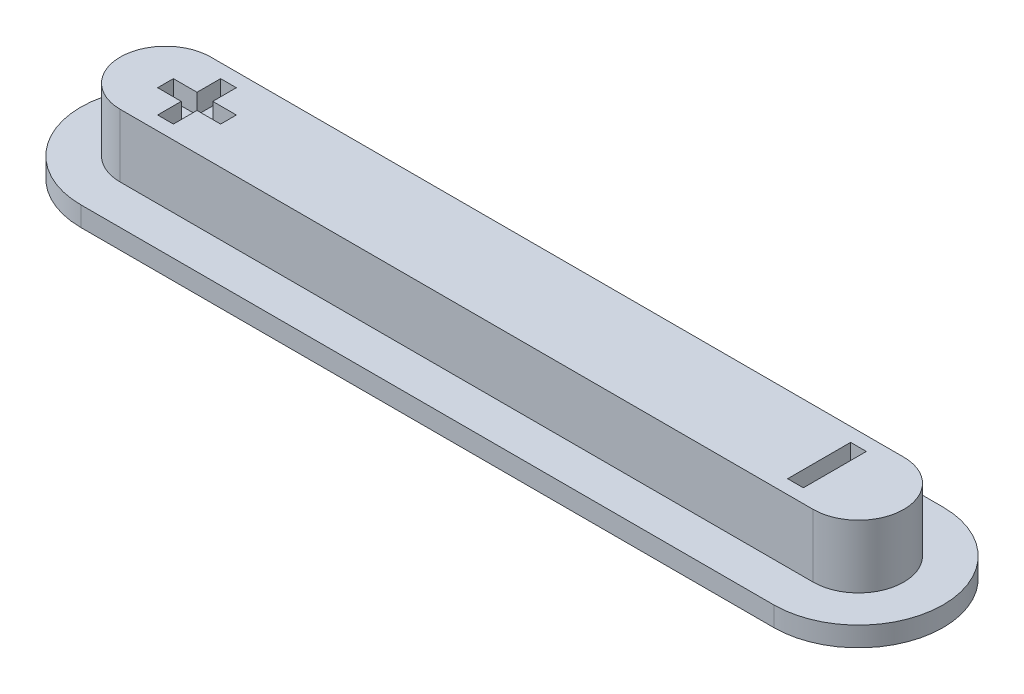
ISO-10303-21;
HEADER;
FILE_DESCRIPTION(('STEP AP214'),'2;1');
FILE_NAME('part.step','',(''),(''),'','','');
FILE_SCHEMA(('AUTOMOTIVE_DESIGN { 1 0 10303 214 1 1 1 1 }'));
ENDSEC;
DATA;
#1=APPLICATION_CONTEXT('core data for automotive mechanical design processes');
#2=APPLICATION_PROTOCOL_DEFINITION('international standard','automotive_design',2000,#1);
#3=PRODUCT_CONTEXT('',#1,'mechanical');
#4=PRODUCT('Part','Part','',(#3));
#5=PRODUCT_RELATED_PRODUCT_CATEGORY('part','',(#4));
#6=PRODUCT_DEFINITION_FORMATION('','',#4);
#7=PRODUCT_DEFINITION_CONTEXT('part definition',#1,'design');
#8=PRODUCT_DEFINITION('design','',#6,#7);
#9=PRODUCT_DEFINITION_SHAPE('','',#8);
#10=(LENGTH_UNIT() NAMED_UNIT(*) SI_UNIT(.MILLI.,.METRE.));
#11=(NAMED_UNIT(*) PLANE_ANGLE_UNIT() SI_UNIT($,.RADIAN.));
#12=(NAMED_UNIT(*) SI_UNIT($,.STERADIAN.) SOLID_ANGLE_UNIT());
#13=UNCERTAINTY_MEASURE_WITH_UNIT(LENGTH_MEASURE(1.E-05),#10,'distance_accuracy_value','');
#14=(GEOMETRIC_REPRESENTATION_CONTEXT(3) GLOBAL_UNCERTAINTY_ASSIGNED_CONTEXT((#13)) GLOBAL_UNIT_ASSIGNED_CONTEXT((#10,
#11,#12)) REPRESENTATION_CONTEXT('',''));
#15=CARTESIAN_POINT('',(0.,0.,0.));
#16=DIRECTION('',(0.,0.,1.));
#17=DIRECTION('',(1.,0.,0.));
#18=AXIS2_PLACEMENT_3D('',#15,#16,#17);
#19=CARTESIAN_POINT('',(-8.8,1.6,0.));
#20=DIRECTION('',(0.,1.,0.));
#21=DIRECTION('',(0.,0.,1.));
#22=AXIS2_PLACEMENT_3D('',#19,#20,#21);
#23=PLANE('',#22);
#24=DIRECTION('',(0.,0.,1.));
#25=VECTOR('',#24,1.);
#26=CARTESIAN_POINT('',(-8.8,1.6,0.));
#27=LINE('',#26,#25);
#28=CARTESIAN_POINT('',(-8.8,1.6,-0.200000000000003));
#29=VERTEX_POINT('',#28);
#30=CARTESIAN_POINT('',(-8.8,1.6,0.199999999999997));
#31=VERTEX_POINT('',#30);
#32=EDGE_CURVE('E58',#29,#31,#27,.T.);
#33=ORIENTED_EDGE('',*,*,#32,.F.);
#34=DIRECTION('',(1.,0.,0.));
#35=VECTOR('',#34,1.);
#36=CARTESIAN_POINT('',(0.,1.6,-0.200000000000005));
#37=LINE('',#36,#35);
#38=CARTESIAN_POINT('',(-8.2,1.6,-0.200000000000003));
#39=VERTEX_POINT('',#38);
#40=EDGE_CURVE('E240',#29,#39,#37,.T.);
#41=ORIENTED_EDGE('',*,*,#40,.T.);
#42=DIRECTION('',(0.,0.,1.));
#43=VECTOR('',#42,1.);
#44=CARTESIAN_POINT('',(-8.2,1.6,0.));
#45=LINE('',#44,#43);
#46=CARTESIAN_POINT('',(-8.2,1.6,-0.800000000000003));
#47=VERTEX_POINT('',#46);
#48=EDGE_CURVE('E296',#47,#39,#45,.T.);
#49=ORIENTED_EDGE('',*,*,#48,.F.);
#50=DIRECTION('',(1.,0.,0.));
#51=VECTOR('',#50,1.);
#52=CARTESIAN_POINT('',(0.,1.6,-0.799999999999999));
#53=LINE('',#52,#51);
#54=CARTESIAN_POINT('',(-7.8,1.6,-0.800000000000003));
#55=VERTEX_POINT('',#54);
#56=EDGE_CURVE('E293',#47,#55,#53,.T.);
#57=ORIENTED_EDGE('',*,*,#56,.T.);
#58=DIRECTION('',(0.,0.,1.));
#59=VECTOR('',#58,1.);
#60=CARTESIAN_POINT('',(-7.8,1.6,0.));
#61=LINE('',#60,#59);
#62=CARTESIAN_POINT('',(-7.8,1.6,-0.200000000000003));
#63=VERTEX_POINT('',#62);
#64=EDGE_CURVE('E290',#55,#63,#61,.T.);
#65=ORIENTED_EDGE('',*,*,#64,.T.);
#66=DIRECTION('',(1.,0.,0.));
#67=VECTOR('',#66,1.);
#68=CARTESIAN_POINT('',(0.,1.6,-0.200000000000005));
#69=LINE('',#68,#67);
#70=CARTESIAN_POINT('',(-7.2,1.6,-0.200000000000004));
#71=VERTEX_POINT('',#70);
#72=EDGE_CURVE('E287',#63,#71,#69,.T.);
#73=ORIENTED_EDGE('',*,*,#72,.T.);
#74=DIRECTION('',(0.,0.,1.));
#75=VECTOR('',#74,1.);
#76=CARTESIAN_POINT('',(-7.2,1.6,0.));
#77=LINE('',#76,#75);
#78=CARTESIAN_POINT('',(-7.2,1.6,0.199999999999996));
#79=VERTEX_POINT('',#78);
#80=EDGE_CURVE('E284',#71,#79,#77,.T.);
#81=ORIENTED_EDGE('',*,*,#80,.T.);
#82=DIRECTION('',(1.,0.,0.));
#83=VECTOR('',#82,1.);
#84=CARTESIAN_POINT('',(0.,1.6,0.199999999999995));
#85=LINE('',#84,#83);
#86=CARTESIAN_POINT('',(-7.8,1.6,0.199999999999997));
#87=VERTEX_POINT('',#86);
#88=EDGE_CURVE('E281',#87,#79,#85,.T.);
#89=ORIENTED_EDGE('',*,*,#88,.F.);
#90=DIRECTION('',(0.,0.,1.));
#91=VECTOR('',#90,1.);
#92=CARTESIAN_POINT('',(-7.8,1.6,0.));
#93=LINE('',#92,#91);
#94=CARTESIAN_POINT('',(-7.8,1.6,0.799999999999997));
#95=VERTEX_POINT('',#94);
#96=EDGE_CURVE('E278',#87,#95,#93,.T.);
#97=ORIENTED_EDGE('',*,*,#96,.T.);
#98=DIRECTION('',(1.,0.,0.));
#99=VECTOR('',#98,1.);
#100=CARTESIAN_POINT('',(0.,1.6,0.799999999999997));
#101=LINE('',#100,#99);
#102=CARTESIAN_POINT('',(-8.2,1.6,0.799999999999997));
#103=VERTEX_POINT('',#102);
#104=EDGE_CURVE('E275',#103,#95,#101,.T.);
#105=ORIENTED_EDGE('',*,*,#104,.F.);
#106=DIRECTION('',(0.,0.,1.));
#107=VECTOR('',#106,1.);
#108=CARTESIAN_POINT('',(-8.2,1.6,0.));
#109=LINE('',#108,#107);
#110=CARTESIAN_POINT('',(-8.2,1.6,0.199999999999997));
#111=VERTEX_POINT('',#110);
#112=EDGE_CURVE('E272',#111,#103,#109,.T.);
#113=ORIENTED_EDGE('',*,*,#112,.F.);
#114=DIRECTION('',(1.,0.,0.));
#115=VECTOR('',#114,1.);
#116=CARTESIAN_POINT('',(0.,1.6,0.199999999999995));
#117=LINE('',#116,#115);
#118=EDGE_CURVE('E269',#31,#111,#117,.T.);
#119=ORIENTED_EDGE('',*,*,#118,.F.);
#120=EDGE_LOOP('',(#33,#41,#49,#57,#65,#73,#81,#89,#97,#105,#113,#119));
#121=FACE_BOUND('',#120,.T.);
#122=CARTESIAN_POINT('',(-8.8,1.6,0.));
#123=DIRECTION('',(0.,1.,0.));
#124=DIRECTION('',(0.,0.,1.));
#125=AXIS2_PLACEMENT_3D('',#122,#123,#124);
#126=CIRCLE('',#125,1.15);
#127=CARTESIAN_POINT('',(-8.8,1.6,-1.15));
#128=VERTEX_POINT('',#127);
#129=CARTESIAN_POINT('',(-8.8,1.6,1.15));
#130=VERTEX_POINT('',#129);
#131=EDGE_CURVE('E353',#128,#130,#126,.T.);
#132=ORIENTED_EDGE('',*,*,#131,.T.);
#133=DIRECTION('',(1.,0.,0.));
#134=VECTOR('',#133,1.);
#135=CARTESIAN_POINT('',(-8.8,1.6,1.15));
#136=LINE('',#135,#134);
#137=CARTESIAN_POINT('',(8.8,1.6,1.15));
#138=VERTEX_POINT('',#137);
#139=EDGE_CURVE('E356',#130,#138,#136,.T.);
#140=ORIENTED_EDGE('',*,*,#139,.T.);
#141=CARTESIAN_POINT('',(8.8,1.6,0.));
#142=DIRECTION('',(0.,1.,0.));
#143=DIRECTION('',(0.,0.,1.));
#144=AXIS2_PLACEMENT_3D('',#141,#142,#143);
#145=CIRCLE('',#144,1.15);
#146=CARTESIAN_POINT('',(8.8,1.6,-1.15));
#147=VERTEX_POINT('',#146);
#148=EDGE_CURVE('E359',#138,#147,#145,.T.);
#149=ORIENTED_EDGE('',*,*,#148,.T.);
#150=DIRECTION('',(-1.,0.,0.));
#151=VECTOR('',#150,1.);
#152=CARTESIAN_POINT('',(-8.8,1.6,-1.15));
#153=LINE('',#152,#151);
#154=EDGE_CURVE('E361',#147,#128,#153,.T.);
#155=ORIENTED_EDGE('',*,*,#154,.T.);
#156=EDGE_LOOP('',(#132,#140,#149,#155));
#157=FACE_BOUND('',#156,.T.);
#158=DIRECTION('',(1.,0.,0.));
#159=VECTOR('',#158,1.);
#160=CARTESIAN_POINT('',(0.,1.6,-0.8));
#161=LINE('',#160,#159);
#162=CARTESIAN_POINT('',(7.8,1.6,-0.8));
#163=VERTEX_POINT('',#162);
#164=CARTESIAN_POINT('',(8.2,1.6,-0.8));
#165=VERTEX_POINT('',#164);
#166=EDGE_CURVE('E225',#163,#165,#161,.T.);
#167=ORIENTED_EDGE('',*,*,#166,.T.);
#168=DIRECTION('',(0.,0.,1.));
#169=VECTOR('',#168,1.);
#170=CARTESIAN_POINT('',(8.2,1.6,0.));
#171=LINE('',#170,#169);
#172=CARTESIAN_POINT('',(8.2,1.6,0.8));
#173=VERTEX_POINT('',#172);
#174=EDGE_CURVE('E50',#165,#173,#171,.T.);
#175=ORIENTED_EDGE('',*,*,#174,.T.);
#176=DIRECTION('',(1.,0.,0.));
#177=VECTOR('',#176,1.);
#178=CARTESIAN_POINT('',(0.,1.6,0.8));
#179=LINE('',#178,#177);
#180=CARTESIAN_POINT('',(7.8,1.6,0.8));
#181=VERTEX_POINT('',#180);
#182=EDGE_CURVE('E216',#181,#173,#179,.T.);
#183=ORIENTED_EDGE('',*,*,#182,.F.);
#184=DIRECTION('',(0.,0.,1.));
#185=VECTOR('',#184,1.);
#186=CARTESIAN_POINT('',(7.8,1.6,0.));
#187=LINE('',#186,#185);
#188=EDGE_CURVE('E219',#163,#181,#187,.T.);
#189=ORIENTED_EDGE('',*,*,#188,.F.);
#190=EDGE_LOOP('',(#167,#175,#183,#189));
#191=FACE_BOUND('',#190,.T.);
#192=ADVANCED_FACE('F35',(#121,#157,#191),#23,.T.);
#193=CARTESIAN_POINT('',(-8.8,1.6,0.));
#194=DIRECTION('',(0.,-1.,0.));
#195=DIRECTION('',(0.,0.,-1.));
#196=AXIS2_PLACEMENT_3D('',#193,#194,#195);
#197=CYLINDRICAL_SURFACE('',#196,1.15);
#198=CARTESIAN_POINT('',(-8.8,0.,0.));
#199=DIRECTION('',(0.,1.,0.));
#200=DIRECTION('',(0.,0.,1.));
#201=AXIS2_PLACEMENT_3D('',#198,#199,#200);
#202=CIRCLE('',#201,1.15);
#203=CARTESIAN_POINT('',(-8.8,0.,-1.15));
#204=VERTEX_POINT('',#203);
#205=CARTESIAN_POINT('',(-8.8,0.,1.15));
#206=VERTEX_POINT('',#205);
#207=EDGE_CURVE('E352',#204,#206,#202,.T.);
#208=ORIENTED_EDGE('',*,*,#207,.T.);
#209=DIRECTION('',(0.,-1.,0.));
#210=VECTOR('',#209,1.);
#211=CARTESIAN_POINT('',(-8.8,1.6,1.15));
#212=LINE('',#211,#210);
#213=EDGE_CURVE('E11',#130,#206,#212,.T.);
#214=ORIENTED_EDGE('',*,*,#213,.F.);
#215=ORIENTED_EDGE('',*,*,#131,.F.);
#216=DIRECTION('',(0.,-1.,0.));
#217=VECTOR('',#216,1.);
#218=CARTESIAN_POINT('',(-8.8,1.6,-1.15));
#219=LINE('',#218,#217);
#220=EDGE_CURVE('E363',#128,#204,#219,.T.);
#221=ORIENTED_EDGE('',*,*,#220,.T.);
#222=EDGE_LOOP('',(#208,#214,#215,#221));
#223=FACE_BOUND('',#222,.T.);
#224=ADVANCED_FACE('F37',(#223),#197,.T.);
#225=CARTESIAN_POINT('',(-8.8,1.6,1.15));
#226=DIRECTION('',(0.,0.,-1.));
#227=DIRECTION('',(-1.,0.,0.));
#228=AXIS2_PLACEMENT_3D('',#225,#226,#227);
#229=PLANE('',#228);
#230=DIRECTION('',(1.,0.,0.));
#231=VECTOR('',#230,1.);
#232=CARTESIAN_POINT('',(-8.8,0.,1.15));
#233=LINE('',#232,#231);
#234=CARTESIAN_POINT('',(8.8,0.,1.15));
#235=VERTEX_POINT('',#234);
#236=EDGE_CURVE('E366',#206,#235,#233,.T.);
#237=ORIENTED_EDGE('',*,*,#236,.T.);
#238=DIRECTION('',(0.,-1.,0.));
#239=VECTOR('',#238,1.);
#240=CARTESIAN_POINT('',(8.8,1.6,1.15));
#241=LINE('',#240,#239);
#242=EDGE_CURVE('E43',#138,#235,#241,.T.);
#243=ORIENTED_EDGE('',*,*,#242,.F.);
#244=ORIENTED_EDGE('',*,*,#139,.F.);
#245=ORIENTED_EDGE('',*,*,#213,.T.);
#246=EDGE_LOOP('',(#237,#243,#244,#245));
#247=FACE_BOUND('',#246,.T.);
#248=ADVANCED_FACE('F385',(#247),#229,.F.);
#249=CARTESIAN_POINT('',(8.8,1.6,0.));
#250=DIRECTION('',(0.,-1.,0.));
#251=DIRECTION('',(0.,0.,-1.));
#252=AXIS2_PLACEMENT_3D('',#249,#250,#251);
#253=CYLINDRICAL_SURFACE('',#252,1.15);
#254=CARTESIAN_POINT('',(8.8,0.,0.));
#255=DIRECTION('',(0.,1.,0.));
#256=DIRECTION('',(0.,0.,1.));
#257=AXIS2_PLACEMENT_3D('',#254,#255,#256);
#258=CIRCLE('',#257,1.15);
#259=CARTESIAN_POINT('',(8.8,0.,-1.15));
#260=VERTEX_POINT('',#259);
#261=EDGE_CURVE('E369',#235,#260,#258,.T.);
#262=ORIENTED_EDGE('',*,*,#261,.T.);
#263=DIRECTION('',(0.,-1.,0.));
#264=VECTOR('',#263,1.);
#265=CARTESIAN_POINT('',(8.8,1.6,-1.15));
#266=LINE('',#265,#264);
#267=EDGE_CURVE('E376',#147,#260,#266,.T.);
#268=ORIENTED_EDGE('',*,*,#267,.F.);
#269=ORIENTED_EDGE('',*,*,#148,.F.);
#270=ORIENTED_EDGE('',*,*,#242,.T.);
#271=EDGE_LOOP('',(#262,#268,#269,#270));
#272=FACE_BOUND('',#271,.T.);
#273=ADVANCED_FACE('F382',(#272),#253,.T.);
#274=CARTESIAN_POINT('',(-8.8,1.6,-1.15));
#275=DIRECTION('',(0.,0.,1.));
#276=DIRECTION('',(1.,0.,0.));
#277=AXIS2_PLACEMENT_3D('',#274,#275,#276);
#278=PLANE('',#277);
#279=DIRECTION('',(-1.,0.,0.));
#280=VECTOR('',#279,1.);
#281=CARTESIAN_POINT('',(-8.8,0.,-1.15));
#282=LINE('',#281,#280);
#283=EDGE_CURVE('E357',#260,#204,#282,.T.);
#284=ORIENTED_EDGE('',*,*,#283,.T.);
#285=ORIENTED_EDGE('',*,*,#220,.F.);
#286=ORIENTED_EDGE('',*,*,#154,.F.);
#287=ORIENTED_EDGE('',*,*,#267,.T.);
#288=EDGE_LOOP('',(#284,#285,#286,#287));
#289=FACE_BOUND('',#288,.T.);
#290=ADVANCED_FACE('F392',(#289),#278,.F.);
#291=CARTESIAN_POINT('',(-8.8,-0.5,0.));
#292=DIRECTION('',(0.,1.,0.));
#293=DIRECTION('',(0.,0.,1.));
#294=AXIS2_PLACEMENT_3D('',#291,#292,#293);
#295=CYLINDRICAL_SURFACE('',#294,2.15);
#296=CARTESIAN_POINT('',(-8.8,0.,0.));
#297=DIRECTION('',(0.,-1.,0.));
#298=DIRECTION('',(0.,0.,-1.));
#299=AXIS2_PLACEMENT_3D('',#296,#297,#298);
#300=CIRCLE('',#299,2.15);
#301=CARTESIAN_POINT('',(-8.8,0.,2.15));
#302=VERTEX_POINT('',#301);
#303=CARTESIAN_POINT('',(-8.8,0.,-2.15));
#304=VERTEX_POINT('',#303);
#305=EDGE_CURVE('E232',#302,#304,#300,.T.);
#306=ORIENTED_EDGE('',*,*,#305,.T.);
#307=DIRECTION('',(0.,1.,0.));
#308=VECTOR('',#307,1.);
#309=CARTESIAN_POINT('',(-8.8,-0.5,-2.15));
#310=LINE('',#309,#308);
#311=CARTESIAN_POINT('',(-8.8,-0.5,-2.15));
#312=VERTEX_POINT('',#311);
#313=EDGE_CURVE('E349',#312,#304,#310,.T.);
#314=ORIENTED_EDGE('',*,*,#313,.F.);
#315=CARTESIAN_POINT('',(-8.8,-0.5,0.));
#316=DIRECTION('',(0.,-1.,0.));
#317=DIRECTION('',(0.,0.,-1.));
#318=AXIS2_PLACEMENT_3D('',#315,#316,#317);
#319=CIRCLE('',#318,2.15);
#320=CARTESIAN_POINT('',(-8.8,-0.5,2.15));
#321=VERTEX_POINT('',#320);
#322=EDGE_CURVE('E323',#321,#312,#319,.T.);
#323=ORIENTED_EDGE('',*,*,#322,.F.);
#324=DIRECTION('',(0.,1.,0.));
#325=VECTOR('',#324,1.);
#326=CARTESIAN_POINT('',(-8.8,-0.5,2.15));
#327=LINE('',#326,#325);
#328=EDGE_CURVE('E333',#321,#302,#327,.T.);
#329=ORIENTED_EDGE('',*,*,#328,.T.);
#330=EDGE_LOOP('',(#306,#314,#323,#329));
#331=FACE_BOUND('',#330,.T.);
#332=ADVANCED_FACE('F487',(#331),#295,.T.);
#333=CARTESIAN_POINT('',(-8.8,-0.5,-2.15));
#334=DIRECTION('',(0.,0.,1.));
#335=DIRECTION('',(1.,0.,0.));
#336=AXIS2_PLACEMENT_3D('',#333,#334,#335);
#337=PLANE('',#336);
#338=DIRECTION('',(1.,0.,0.));
#339=VECTOR('',#338,1.);
#340=CARTESIAN_POINT('',(-8.8,0.,-2.15));
#341=LINE('',#340,#339);
#342=CARTESIAN_POINT('',(8.8,0.,-2.15));
#343=VERTEX_POINT('',#342);
#344=EDGE_CURVE('E336',#304,#343,#341,.T.);
#345=ORIENTED_EDGE('',*,*,#344,.T.);
#346=DIRECTION('',(0.,1.,0.));
#347=VECTOR('',#346,1.);
#348=CARTESIAN_POINT('',(8.8,-0.5,-2.15));
#349=LINE('',#348,#347);
#350=CARTESIAN_POINT('',(8.8,-0.5,-2.15));
#351=VERTEX_POINT('',#350);
#352=EDGE_CURVE('E346',#351,#343,#349,.T.);
#353=ORIENTED_EDGE('',*,*,#352,.F.);
#354=DIRECTION('',(1.,0.,0.));
#355=VECTOR('',#354,1.);
#356=CARTESIAN_POINT('',(-8.8,-0.5,-2.15));
#357=LINE('',#356,#355);
#358=EDGE_CURVE('E326',#312,#351,#357,.T.);
#359=ORIENTED_EDGE('',*,*,#358,.F.);
#360=ORIENTED_EDGE('',*,*,#313,.T.);
#361=EDGE_LOOP('',(#345,#353,#359,#360));
#362=FACE_BOUND('',#361,.T.);
#363=ADVANCED_FACE('F483',(#362),#337,.F.);
#364=CARTESIAN_POINT('',(8.8,-0.5,0.));
#365=DIRECTION('',(0.,1.,0.));
#366=DIRECTION('',(0.,0.,1.));
#367=AXIS2_PLACEMENT_3D('',#364,#365,#366);
#368=CYLINDRICAL_SURFACE('',#367,2.15);
#369=CARTESIAN_POINT('',(8.8,0.,0.));
#370=DIRECTION('',(0.,-1.,0.));
#371=DIRECTION('',(0.,0.,-1.));
#372=AXIS2_PLACEMENT_3D('',#369,#370,#371);
#373=CIRCLE('',#372,2.15);
#374=CARTESIAN_POINT('',(8.8,0.,2.15));
#375=VERTEX_POINT('',#374);
#376=EDGE_CURVE('E338',#343,#375,#373,.T.);
#377=ORIENTED_EDGE('',*,*,#376,.T.);
#378=DIRECTION('',(0.,1.,0.));
#379=VECTOR('',#378,1.);
#380=CARTESIAN_POINT('',(8.8,-0.5,2.15));
#381=LINE('',#380,#379);
#382=CARTESIAN_POINT('',(8.8,-0.5,2.15));
#383=VERTEX_POINT('',#382);
#384=EDGE_CURVE('E343',#383,#375,#381,.T.);
#385=ORIENTED_EDGE('',*,*,#384,.F.);
#386=CARTESIAN_POINT('',(8.8,-0.5,0.));
#387=DIRECTION('',(0.,-1.,0.));
#388=DIRECTION('',(0.,0.,-1.));
#389=AXIS2_PLACEMENT_3D('',#386,#387,#388);
#390=CIRCLE('',#389,2.15);
#391=EDGE_CURVE('E329',#351,#383,#390,.T.);
#392=ORIENTED_EDGE('',*,*,#391,.F.);
#393=ORIENTED_EDGE('',*,*,#352,.T.);
#394=EDGE_LOOP('',(#377,#385,#392,#393));
#395=FACE_BOUND('',#394,.T.);
#396=ADVANCED_FACE('F479',(#395),#368,.T.);
#397=CARTESIAN_POINT('',(8.8,-0.5,2.15));
#398=DIRECTION('',(0.,0.,-1.));
#399=DIRECTION('',(-1.,0.,0.));
#400=AXIS2_PLACEMENT_3D('',#397,#398,#399);
#401=PLANE('',#400);
#402=DIRECTION('',(-1.,0.,0.));
#403=VECTOR('',#402,1.);
#404=CARTESIAN_POINT('',(8.8,0.,2.15));
#405=LINE('',#404,#403);
#406=EDGE_CURVE('E327',#375,#302,#405,.T.);
#407=ORIENTED_EDGE('',*,*,#406,.T.);
#408=ORIENTED_EDGE('',*,*,#328,.F.);
#409=DIRECTION('',(-1.,0.,0.));
#410=VECTOR('',#409,1.);
#411=CARTESIAN_POINT('',(8.8,-0.5,2.15));
#412=LINE('',#411,#410);
#413=EDGE_CURVE('E331',#383,#321,#412,.T.);
#414=ORIENTED_EDGE('',*,*,#413,.F.);
#415=ORIENTED_EDGE('',*,*,#384,.T.);
#416=EDGE_LOOP('',(#407,#408,#414,#415));
#417=FACE_BOUND('',#416,.T.);
#418=ADVANCED_FACE('F473',(#417),#401,.F.);
#419=CARTESIAN_POINT('',(-8.8,-0.5,0.));
#420=DIRECTION('',(0.,-1.,0.));
#421=DIRECTION('',(0.,0.,-1.));
#422=AXIS2_PLACEMENT_3D('',#419,#420,#421);
#423=PLANE('',#422);
#424=ORIENTED_EDGE('',*,*,#322,.T.);
#425=ORIENTED_EDGE('',*,*,#358,.T.);
#426=ORIENTED_EDGE('',*,*,#391,.T.);
#427=ORIENTED_EDGE('',*,*,#413,.T.);
#428=EDGE_LOOP('',(#424,#425,#426,#427));
#429=FACE_BOUND('',#428,.T.);
#430=ADVANCED_FACE('F470',(#429),#423,.T.);
#431=CARTESIAN_POINT('',(-8.8,0.,0.));
#432=DIRECTION('',(0.,-1.,0.));
#433=DIRECTION('',(0.,0.,-1.));
#434=AXIS2_PLACEMENT_3D('',#431,#432,#433);
#435=PLANE('',#434);
#436=ORIENTED_EDGE('',*,*,#207,.F.);
#437=ORIENTED_EDGE('',*,*,#283,.F.);
#438=ORIENTED_EDGE('',*,*,#261,.F.);
#439=ORIENTED_EDGE('',*,*,#236,.F.);
#440=EDGE_LOOP('',(#436,#437,#438,#439));
#441=FACE_BOUND('',#440,.T.);
#442=ORIENTED_EDGE('',*,*,#305,.F.);
#443=ORIENTED_EDGE('',*,*,#406,.F.);
#444=ORIENTED_EDGE('',*,*,#376,.F.);
#445=ORIENTED_EDGE('',*,*,#344,.F.);
#446=EDGE_LOOP('',(#442,#443,#444,#445));
#447=FACE_BOUND('',#446,.T.);
#448=ADVANCED_FACE('F388',(#441,#447),#435,.F.);
#449=CARTESIAN_POINT('',(-8.8,1.1,0.));
#450=DIRECTION('',(-1.,0.,0.));
#451=DIRECTION('',(0.,0.,1.));
#452=AXIS2_PLACEMENT_3D('',#449,#450,#451);
#453=PLANE('',#452);
#454=ORIENTED_EDGE('',*,*,#32,.T.);
#455=DIRECTION('',(0.,1.,0.));
#456=VECTOR('',#455,1.);
#457=CARTESIAN_POINT('',(-8.8,1.1,0.199999999999997));
#458=LINE('',#457,#456);
#459=CARTESIAN_POINT('',(-8.8,1.1,0.199999999999997));
#460=VERTEX_POINT('',#459);
#461=EDGE_CURVE('E267',#460,#31,#458,.T.);
#462=ORIENTED_EDGE('',*,*,#461,.F.);
#463=DIRECTION('',(0.,0.,1.));
#464=VECTOR('',#463,1.);
#465=CARTESIAN_POINT('',(-8.8,1.1,0.));
#466=LINE('',#465,#464);
#467=CARTESIAN_POINT('',(-8.8,1.1,-0.200000000000003));
#468=VERTEX_POINT('',#467);
#469=EDGE_CURVE('E236',#468,#460,#466,.T.);
#470=ORIENTED_EDGE('',*,*,#469,.F.);
#471=DIRECTION('',(0.,1.,0.));
#472=VECTOR('',#471,1.);
#473=CARTESIAN_POINT('',(-8.8,1.1,-0.200000000000003));
#474=LINE('',#473,#472);
#475=EDGE_CURVE('E226',#468,#29,#474,.T.);
#476=ORIENTED_EDGE('',*,*,#475,.T.);
#477=EDGE_LOOP('',(#454,#462,#470,#476));
#478=FACE_BOUND('',#477,.T.);
#479=ADVANCED_FACE('F428',(#478),#453,.F.);
#480=CARTESIAN_POINT('',(0.,1.1,-0.200000000000005));
#481=DIRECTION('',(0.,0.,1.));
#482=DIRECTION('',(1.,0.,0.));
#483=AXIS2_PLACEMENT_3D('',#480,#481,#482);
#484=PLANE('',#483);
#485=ORIENTED_EDGE('',*,*,#40,.F.);
#486=ORIENTED_EDGE('',*,*,#475,.F.);
#487=DIRECTION('',(1.,0.,0.));
#488=VECTOR('',#487,1.);
#489=CARTESIAN_POINT('',(0.,1.1,-0.200000000000005));
#490=LINE('',#489,#488);
#491=CARTESIAN_POINT('',(-8.2,1.1,-0.200000000000003));
#492=VERTEX_POINT('',#491);
#493=EDGE_CURVE('E265',#468,#492,#490,.T.);
#494=ORIENTED_EDGE('',*,*,#493,.T.);
#495=DIRECTION('',(0.,1.,0.));
#496=VECTOR('',#495,1.);
#497=CARTESIAN_POINT('',(-8.2,1.1,-0.200000000000003));
#498=LINE('',#497,#496);
#499=EDGE_CURVE('E302',#492,#39,#498,.T.);
#500=ORIENTED_EDGE('',*,*,#499,.T.);
#501=EDGE_LOOP('',(#485,#486,#494,#500));
#502=FACE_BOUND('',#501,.T.);
#503=ADVANCED_FACE('F424',(#502),#484,.T.);
#504=CARTESIAN_POINT('',(-8.2,1.1,0.));
#505=DIRECTION('',(-1.,0.,0.));
#506=DIRECTION('',(0.,0.,1.));
#507=AXIS2_PLACEMENT_3D('',#504,#505,#506);
#508=PLANE('',#507);
#509=ORIENTED_EDGE('',*,*,#48,.T.);
#510=ORIENTED_EDGE('',*,*,#499,.F.);
#511=DIRECTION('',(0.,0.,1.));
#512=VECTOR('',#511,1.);
#513=CARTESIAN_POINT('',(-8.2,1.1,0.));
#514=LINE('',#513,#512);
#515=CARTESIAN_POINT('',(-8.2,1.1,-0.800000000000003));
#516=VERTEX_POINT('',#515);
#517=EDGE_CURVE('E262',#516,#492,#514,.T.);
#518=ORIENTED_EDGE('',*,*,#517,.F.);
#519=DIRECTION('',(0.,1.,0.));
#520=VECTOR('',#519,1.);
#521=CARTESIAN_POINT('',(-8.2,1.1,-0.800000000000003));
#522=LINE('',#521,#520);
#523=EDGE_CURVE('E304',#516,#47,#522,.T.);
#524=ORIENTED_EDGE('',*,*,#523,.T.);
#525=EDGE_LOOP('',(#509,#510,#518,#524));
#526=FACE_BOUND('',#525,.T.);
#527=ADVANCED_FACE('F427',(#526),#508,.F.);
#528=CARTESIAN_POINT('',(0.,1.1,-0.799999999999999));
#529=DIRECTION('',(0.,0.,1.));
#530=DIRECTION('',(1.,0.,0.));
#531=AXIS2_PLACEMENT_3D('',#528,#529,#530);
#532=PLANE('',#531);
#533=ORIENTED_EDGE('',*,*,#56,.F.);
#534=ORIENTED_EDGE('',*,*,#523,.F.);
#535=DIRECTION('',(1.,0.,0.));
#536=VECTOR('',#535,1.);
#537=CARTESIAN_POINT('',(0.,1.1,-0.799999999999999));
#538=LINE('',#537,#536);
#539=CARTESIAN_POINT('',(-7.8,1.1,-0.800000000000003));
#540=VERTEX_POINT('',#539);
#541=EDGE_CURVE('E260',#516,#540,#538,.T.);
#542=ORIENTED_EDGE('',*,*,#541,.T.);
#543=DIRECTION('',(0.,1.,0.));
#544=VECTOR('',#543,1.);
#545=CARTESIAN_POINT('',(-7.8,1.1,-0.800000000000003));
#546=LINE('',#545,#544);
#547=EDGE_CURVE('E306',#540,#55,#546,.T.);
#548=ORIENTED_EDGE('',*,*,#547,.T.);
#549=EDGE_LOOP('',(#533,#534,#542,#548));
#550=FACE_BOUND('',#549,.T.);
#551=ADVANCED_FACE('F432',(#550),#532,.T.);
#552=CARTESIAN_POINT('',(-7.8,1.1,0.));
#553=DIRECTION('',(-1.,0.,0.));
#554=DIRECTION('',(0.,0.,1.));
#555=AXIS2_PLACEMENT_3D('',#552,#553,#554);
#556=PLANE('',#555);
#557=ORIENTED_EDGE('',*,*,#64,.F.);
#558=ORIENTED_EDGE('',*,*,#547,.F.);
#559=DIRECTION('',(0.,0.,1.));
#560=VECTOR('',#559,1.);
#561=CARTESIAN_POINT('',(-7.8,1.1,0.));
#562=LINE('',#561,#560);
#563=CARTESIAN_POINT('',(-7.8,1.1,-0.200000000000003));
#564=VERTEX_POINT('',#563);
#565=EDGE_CURVE('E258',#540,#564,#562,.T.);
#566=ORIENTED_EDGE('',*,*,#565,.T.);
#567=DIRECTION('',(0.,1.,0.));
#568=VECTOR('',#567,1.);
#569=CARTESIAN_POINT('',(-7.8,1.1,-0.200000000000003));
#570=LINE('',#569,#568);
#571=EDGE_CURVE('E308',#564,#63,#570,.T.);
#572=ORIENTED_EDGE('',*,*,#571,.T.);
#573=EDGE_LOOP('',(#557,#558,#566,#572));
#574=FACE_BOUND('',#573,.T.);
#575=ADVANCED_FACE('F436',(#574),#556,.T.);
#576=CARTESIAN_POINT('',(0.,1.1,-0.200000000000005));
#577=DIRECTION('',(0.,0.,1.));
#578=DIRECTION('',(1.,0.,0.));
#579=AXIS2_PLACEMENT_3D('',#576,#577,#578);
#580=PLANE('',#579);
#581=ORIENTED_EDGE('',*,*,#72,.F.);
#582=ORIENTED_EDGE('',*,*,#571,.F.);
#583=DIRECTION('',(1.,0.,0.));
#584=VECTOR('',#583,1.);
#585=CARTESIAN_POINT('',(0.,1.1,-0.200000000000005));
#586=LINE('',#585,#584);
#587=CARTESIAN_POINT('',(-7.2,1.1,-0.200000000000004));
#588=VERTEX_POINT('',#587);
#589=EDGE_CURVE('E256',#564,#588,#586,.T.);
#590=ORIENTED_EDGE('',*,*,#589,.T.);
#591=DIRECTION('',(0.,1.,0.));
#592=VECTOR('',#591,1.);
#593=CARTESIAN_POINT('',(-7.2,1.1,-0.200000000000004));
#594=LINE('',#593,#592);
#595=EDGE_CURVE('E310',#588,#71,#594,.T.);
#596=ORIENTED_EDGE('',*,*,#595,.T.);
#597=EDGE_LOOP('',(#581,#582,#590,#596));
#598=FACE_BOUND('',#597,.T.);
#599=ADVANCED_FACE('F440',(#598),#580,.T.);
#600=CARTESIAN_POINT('',(-7.2,1.1,0.));
#601=DIRECTION('',(-1.,0.,0.));
#602=DIRECTION('',(0.,0.,1.));
#603=AXIS2_PLACEMENT_3D('',#600,#601,#602);
#604=PLANE('',#603);
#605=ORIENTED_EDGE('',*,*,#80,.F.);
#606=ORIENTED_EDGE('',*,*,#595,.F.);
#607=DIRECTION('',(0.,0.,1.));
#608=VECTOR('',#607,1.);
#609=CARTESIAN_POINT('',(-7.2,1.1,0.));
#610=LINE('',#609,#608);
#611=CARTESIAN_POINT('',(-7.2,1.1,0.199999999999996));
#612=VERTEX_POINT('',#611);
#613=EDGE_CURVE('E254',#588,#612,#610,.T.);
#614=ORIENTED_EDGE('',*,*,#613,.T.);
#615=DIRECTION('',(0.,1.,0.));
#616=VECTOR('',#615,1.);
#617=CARTESIAN_POINT('',(-7.2,1.1,0.199999999999996));
#618=LINE('',#617,#616);
#619=EDGE_CURVE('E312',#612,#79,#618,.T.);
#620=ORIENTED_EDGE('',*,*,#619,.T.);
#621=EDGE_LOOP('',(#605,#606,#614,#620));
#622=FACE_BOUND('',#621,.T.);
#623=ADVANCED_FACE('F444',(#622),#604,.T.);
#624=CARTESIAN_POINT('',(0.,1.1,0.199999999999995));
#625=DIRECTION('',(0.,0.,1.));
#626=DIRECTION('',(1.,0.,0.));
#627=AXIS2_PLACEMENT_3D('',#624,#625,#626);
#628=PLANE('',#627);
#629=ORIENTED_EDGE('',*,*,#88,.T.);
#630=ORIENTED_EDGE('',*,*,#619,.F.);
#631=DIRECTION('',(1.,0.,0.));
#632=VECTOR('',#631,1.);
#633=CARTESIAN_POINT('',(0.,1.1,0.199999999999995));
#634=LINE('',#633,#632);
#635=CARTESIAN_POINT('',(-7.8,1.1,0.199999999999997));
#636=VERTEX_POINT('',#635);
#637=EDGE_CURVE('E251',#636,#612,#634,.T.);
#638=ORIENTED_EDGE('',*,*,#637,.F.);
#639=DIRECTION('',(0.,1.,0.));
#640=VECTOR('',#639,1.);
#641=CARTESIAN_POINT('',(-7.8,1.1,0.199999999999997));
#642=LINE('',#641,#640);
#643=EDGE_CURVE('E314',#636,#87,#642,.T.);
#644=ORIENTED_EDGE('',*,*,#643,.T.);
#645=EDGE_LOOP('',(#629,#630,#638,#644));
#646=FACE_BOUND('',#645,.T.);
#647=ADVANCED_FACE('F448',(#646),#628,.F.);
#648=CARTESIAN_POINT('',(-7.8,1.1,0.));
#649=DIRECTION('',(-1.,0.,0.));
#650=DIRECTION('',(0.,0.,1.));
#651=AXIS2_PLACEMENT_3D('',#648,#649,#650);
#652=PLANE('',#651);
#653=ORIENTED_EDGE('',*,*,#96,.F.);
#654=ORIENTED_EDGE('',*,*,#643,.F.);
#655=DIRECTION('',(0.,0.,1.));
#656=VECTOR('',#655,1.);
#657=CARTESIAN_POINT('',(-7.8,1.1,0.));
#658=LINE('',#657,#656);
#659=CARTESIAN_POINT('',(-7.8,1.1,0.799999999999997));
#660=VERTEX_POINT('',#659);
#661=EDGE_CURVE('E249',#636,#660,#658,.T.);
#662=ORIENTED_EDGE('',*,*,#661,.T.);
#663=DIRECTION('',(0.,1.,0.));
#664=VECTOR('',#663,1.);
#665=CARTESIAN_POINT('',(-7.8,1.1,0.799999999999997));
#666=LINE('',#665,#664);
#667=EDGE_CURVE('E316',#660,#95,#666,.T.);
#668=ORIENTED_EDGE('',*,*,#667,.T.);
#669=EDGE_LOOP('',(#653,#654,#662,#668));
#670=FACE_BOUND('',#669,.T.);
#671=ADVANCED_FACE('F452',(#670),#652,.T.);
#672=CARTESIAN_POINT('',(0.,1.1,0.799999999999997));
#673=DIRECTION('',(0.,0.,1.));
#674=DIRECTION('',(1.,0.,0.));
#675=AXIS2_PLACEMENT_3D('',#672,#673,#674);
#676=PLANE('',#675);
#677=ORIENTED_EDGE('',*,*,#104,.T.);
#678=ORIENTED_EDGE('',*,*,#667,.F.);
#679=DIRECTION('',(1.,0.,0.));
#680=VECTOR('',#679,1.);
#681=CARTESIAN_POINT('',(0.,1.1,0.799999999999997));
#682=LINE('',#681,#680);
#683=CARTESIAN_POINT('',(-8.2,1.1,0.799999999999997));
#684=VERTEX_POINT('',#683);
#685=EDGE_CURVE('E246',#684,#660,#682,.T.);
#686=ORIENTED_EDGE('',*,*,#685,.F.);
#687=DIRECTION('',(0.,1.,0.));
#688=VECTOR('',#687,1.);
#689=CARTESIAN_POINT('',(-8.2,1.1,0.799999999999997));
#690=LINE('',#689,#688);
#691=EDGE_CURVE('E318',#684,#103,#690,.T.);
#692=ORIENTED_EDGE('',*,*,#691,.T.);
#693=EDGE_LOOP('',(#677,#678,#686,#692));
#694=FACE_BOUND('',#693,.T.);
#695=ADVANCED_FACE('F456',(#694),#676,.F.);
#696=CARTESIAN_POINT('',(-8.2,1.1,0.));
#697=DIRECTION('',(-1.,0.,0.));
#698=DIRECTION('',(0.,0.,1.));
#699=AXIS2_PLACEMENT_3D('',#696,#697,#698);
#700=PLANE('',#699);
#701=ORIENTED_EDGE('',*,*,#112,.T.);
#702=ORIENTED_EDGE('',*,*,#691,.F.);
#703=DIRECTION('',(0.,0.,1.));
#704=VECTOR('',#703,1.);
#705=CARTESIAN_POINT('',(-8.2,1.1,0.));
#706=LINE('',#705,#704);
#707=CARTESIAN_POINT('',(-8.2,1.1,0.199999999999997));
#708=VERTEX_POINT('',#707);
#709=EDGE_CURVE('E243',#708,#684,#706,.T.);
#710=ORIENTED_EDGE('',*,*,#709,.F.);
#711=DIRECTION('',(0.,1.,0.));
#712=VECTOR('',#711,1.);
#713=CARTESIAN_POINT('',(-8.2,1.1,0.199999999999997));
#714=LINE('',#713,#712);
#715=EDGE_CURVE('E320',#708,#111,#714,.T.);
#716=ORIENTED_EDGE('',*,*,#715,.T.);
#717=EDGE_LOOP('',(#701,#702,#710,#716));
#718=FACE_BOUND('',#717,.T.);
#719=ADVANCED_FACE('F460',(#718),#700,.F.);
#720=CARTESIAN_POINT('',(0.,1.1,0.199999999999995));
#721=DIRECTION('',(0.,0.,1.));
#722=DIRECTION('',(1.,0.,0.));
#723=AXIS2_PLACEMENT_3D('',#720,#721,#722);
#724=PLANE('',#723);
#725=ORIENTED_EDGE('',*,*,#118,.T.);
#726=ORIENTED_EDGE('',*,*,#715,.F.);
#727=DIRECTION('',(1.,0.,0.));
#728=VECTOR('',#727,1.);
#729=CARTESIAN_POINT('',(0.,1.1,0.199999999999995));
#730=LINE('',#729,#728);
#731=EDGE_CURVE('E239',#460,#708,#730,.T.);
#732=ORIENTED_EDGE('',*,*,#731,.F.);
#733=ORIENTED_EDGE('',*,*,#461,.T.);
#734=EDGE_LOOP('',(#725,#726,#732,#733));
#735=FACE_BOUND('',#734,.T.);
#736=ADVANCED_FACE('F422',(#735),#724,.F.);
#737=CARTESIAN_POINT('',(0.,1.1,0.));
#738=DIRECTION('',(0.,1.,0.));
#739=DIRECTION('',(0.,0.,1.));
#740=AXIS2_PLACEMENT_3D('',#737,#738,#739);
#741=PLANE('',#740);
#742=ORIENTED_EDGE('',*,*,#469,.T.);
#743=ORIENTED_EDGE('',*,*,#731,.T.);
#744=ORIENTED_EDGE('',*,*,#709,.T.);
#745=ORIENTED_EDGE('',*,*,#685,.T.);
#746=ORIENTED_EDGE('',*,*,#661,.F.);
#747=ORIENTED_EDGE('',*,*,#637,.T.);
#748=ORIENTED_EDGE('',*,*,#613,.F.);
#749=ORIENTED_EDGE('',*,*,#589,.F.);
#750=ORIENTED_EDGE('',*,*,#565,.F.);
#751=ORIENTED_EDGE('',*,*,#541,.F.);
#752=ORIENTED_EDGE('',*,*,#517,.T.);
#753=ORIENTED_EDGE('',*,*,#493,.F.);
#754=EDGE_LOOP('',(#742,#743,#744,#745,#746,#747,#748,#749,#750,#751,#752,#753));
#755=FACE_BOUND('',#754,.T.);
#756=ADVANCED_FACE('F414',(#755),#741,.T.);
#757=CARTESIAN_POINT('',(8.2,1.1,0.));
#758=DIRECTION('',(-1.,0.,0.));
#759=DIRECTION('',(0.,0.,1.));
#760=AXIS2_PLACEMENT_3D('',#757,#758,#759);
#761=PLANE('',#760);
#762=ORIENTED_EDGE('',*,*,#174,.F.);
#763=DIRECTION('',(0.,1.,0.));
#764=VECTOR('',#763,1.);
#765=CARTESIAN_POINT('',(8.2,1.1,-0.8));
#766=LINE('',#765,#764);
#767=CARTESIAN_POINT('',(8.2,1.1,-0.8));
#768=VERTEX_POINT('',#767);
#769=EDGE_CURVE('E199',#768,#165,#766,.T.);
#770=ORIENTED_EDGE('',*,*,#769,.F.);
#771=DIRECTION('',(0.,0.,1.));
#772=VECTOR('',#771,1.);
#773=CARTESIAN_POINT('',(8.2,1.1,0.));
#774=LINE('',#773,#772);
#775=CARTESIAN_POINT('',(8.2,1.1,0.8));
#776=VERTEX_POINT('',#775);
#777=EDGE_CURVE('E207',#768,#776,#774,.T.);
#778=ORIENTED_EDGE('',*,*,#777,.T.);
#779=DIRECTION('',(0.,1.,0.));
#780=VECTOR('',#779,1.);
#781=CARTESIAN_POINT('',(8.2,1.1,0.8));
#782=LINE('',#781,#780);
#783=EDGE_CURVE('E230',#776,#173,#782,.T.);
#784=ORIENTED_EDGE('',*,*,#783,.T.);
#785=EDGE_LOOP('',(#762,#770,#778,#784));
#786=FACE_BOUND('',#785,.T.);
#787=ADVANCED_FACE('F209',(#786),#761,.T.);
#788=CARTESIAN_POINT('',(0.,1.1,0.8));
#789=DIRECTION('',(0.,0.,1.));
#790=DIRECTION('',(1.,0.,0.));
#791=AXIS2_PLACEMENT_3D('',#788,#789,#790);
#792=PLANE('',#791);
#793=ORIENTED_EDGE('',*,*,#182,.T.);
#794=ORIENTED_EDGE('',*,*,#783,.F.);
#795=DIRECTION('',(1.,0.,0.));
#796=VECTOR('',#795,1.);
#797=CARTESIAN_POINT('',(0.,1.1,0.8));
#798=LINE('',#797,#796);
#799=CARTESIAN_POINT('',(7.8,1.1,0.8));
#800=VERTEX_POINT('',#799);
#801=EDGE_CURVE('E211',#800,#776,#798,.T.);
#802=ORIENTED_EDGE('',*,*,#801,.F.);
#803=DIRECTION('',(0.,1.,0.));
#804=VECTOR('',#803,1.);
#805=CARTESIAN_POINT('',(7.8,1.1,0.8));
#806=LINE('',#805,#804);
#807=EDGE_CURVE('E233',#800,#181,#806,.T.);
#808=ORIENTED_EDGE('',*,*,#807,.T.);
#809=EDGE_LOOP('',(#793,#794,#802,#808));
#810=FACE_BOUND('',#809,.T.);
#811=ADVANCED_FACE('F406',(#810),#792,.F.);
#812=CARTESIAN_POINT('',(7.8,1.1,0.));
#813=DIRECTION('',(-1.,0.,0.));
#814=DIRECTION('',(0.,0.,1.));
#815=AXIS2_PLACEMENT_3D('',#812,#813,#814);
#816=PLANE('',#815);
#817=ORIENTED_EDGE('',*,*,#188,.T.);
#818=ORIENTED_EDGE('',*,*,#807,.F.);
#819=DIRECTION('',(0.,0.,1.));
#820=VECTOR('',#819,1.);
#821=CARTESIAN_POINT('',(7.8,1.1,0.));
#822=LINE('',#821,#820);
#823=CARTESIAN_POINT('',(7.8,1.1,-0.8));
#824=VERTEX_POINT('',#823);
#825=EDGE_CURVE('E206',#824,#800,#822,.T.);
#826=ORIENTED_EDGE('',*,*,#825,.F.);
#827=DIRECTION('',(0.,1.,0.));
#828=VECTOR('',#827,1.);
#829=CARTESIAN_POINT('',(7.8,1.1,-0.8));
#830=LINE('',#829,#828);
#831=EDGE_CURVE('E201',#824,#163,#830,.T.);
#832=ORIENTED_EDGE('',*,*,#831,.T.);
#833=EDGE_LOOP('',(#817,#818,#826,#832));
#834=FACE_BOUND('',#833,.T.);
#835=ADVANCED_FACE('F404',(#834),#816,.F.);
#836=CARTESIAN_POINT('',(0.,1.1,-0.8));
#837=DIRECTION('',(0.,0.,1.));
#838=DIRECTION('',(1.,0.,0.));
#839=AXIS2_PLACEMENT_3D('',#836,#837,#838);
#840=PLANE('',#839);
#841=ORIENTED_EDGE('',*,*,#166,.F.);
#842=ORIENTED_EDGE('',*,*,#831,.F.);
#843=DIRECTION('',(1.,0.,0.));
#844=VECTOR('',#843,1.);
#845=CARTESIAN_POINT('',(0.,1.1,-0.8));
#846=LINE('',#845,#844);
#847=EDGE_CURVE('E196',#824,#768,#846,.T.);
#848=ORIENTED_EDGE('',*,*,#847,.T.);
#849=ORIENTED_EDGE('',*,*,#769,.T.);
#850=EDGE_LOOP('',(#841,#842,#848,#849));
#851=FACE_BOUND('',#850,.T.);
#852=ADVANCED_FACE('F198',(#851),#840,.T.);
#853=CARTESIAN_POINT('',(0.,1.1,0.));
#854=DIRECTION('',(0.,1.,0.));
#855=DIRECTION('',(0.,0.,1.));
#856=AXIS2_PLACEMENT_3D('',#853,#854,#855);
#857=PLANE('',#856);
#858=ORIENTED_EDGE('',*,*,#777,.F.);
#859=ORIENTED_EDGE('',*,*,#847,.F.);
#860=ORIENTED_EDGE('',*,*,#825,.T.);
#861=ORIENTED_EDGE('',*,*,#801,.T.);
#862=EDGE_LOOP('',(#858,#859,#860,#861));
#863=FACE_BOUND('',#862,.T.);
#864=ADVANCED_FACE('F214',(#863),#857,.T.);
#865=CLOSED_SHELL('',(#192,#224,#248,#273,#290,#332,#363,#396,#418,#430,#448,#479,#503,#527,
#551,#575,#599,#623,#647,#671,#695,#719,#736,#756,#787,#811,#835,#852,#864));
#866=MANIFOLD_SOLID_BREP('B2',#865);
#867=ADVANCED_BREP_SHAPE_REPRESENTATION('',(#18,#866),#14);
#868=SHAPE_DEFINITION_REPRESENTATION(#9,#867);
ENDSEC;
END-ISO-10303-21;
